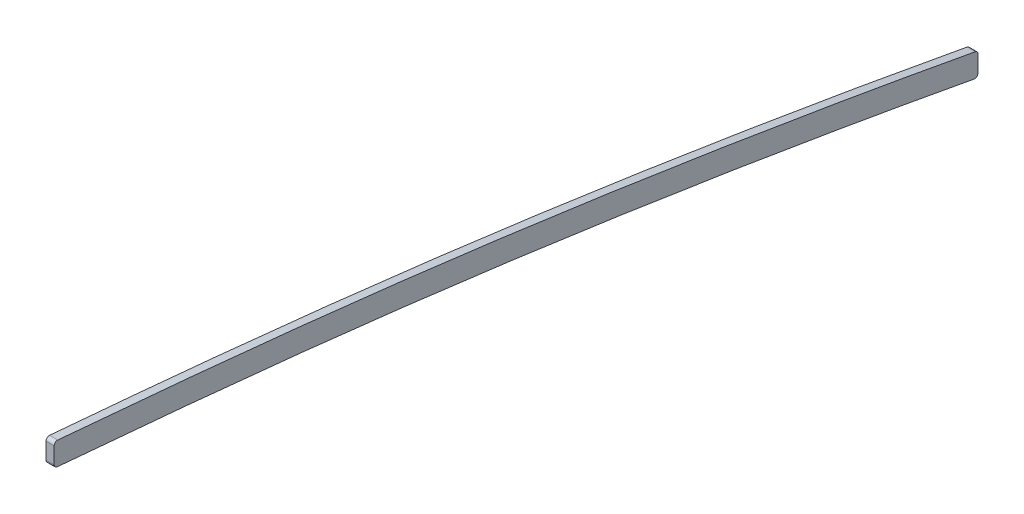
ISO-10303-21;
HEADER;
FILE_DESCRIPTION(('STEP AP214'),'2;1');
FILE_NAME('part.step','',(''),(''),'','','');
FILE_SCHEMA(('AUTOMOTIVE_DESIGN { 1 0 10303 214 1 1 1 1 }'));
ENDSEC;
DATA;
#1=APPLICATION_CONTEXT('core data for automotive mechanical design processes');
#2=APPLICATION_PROTOCOL_DEFINITION('international standard','automotive_design',2000,#1);
#3=PRODUCT_CONTEXT('',#1,'mechanical');
#4=PRODUCT('Part','Part','',(#3));
#5=PRODUCT_RELATED_PRODUCT_CATEGORY('part','',(#4));
#6=PRODUCT_DEFINITION_FORMATION('','',#4);
#7=PRODUCT_DEFINITION_CONTEXT('part definition',#1,'design');
#8=PRODUCT_DEFINITION('design','',#6,#7);
#9=PRODUCT_DEFINITION_SHAPE('','',#8);
#10=(LENGTH_UNIT() NAMED_UNIT(*) SI_UNIT(.MILLI.,.METRE.));
#11=(NAMED_UNIT(*) PLANE_ANGLE_UNIT() SI_UNIT($,.RADIAN.));
#12=(NAMED_UNIT(*) SI_UNIT($,.STERADIAN.) SOLID_ANGLE_UNIT());
#13=UNCERTAINTY_MEASURE_WITH_UNIT(LENGTH_MEASURE(1.E-05),#10,'distance_accuracy_value','');
#14=(GEOMETRIC_REPRESENTATION_CONTEXT(3) GLOBAL_UNCERTAINTY_ASSIGNED_CONTEXT((#13)) GLOBAL_UNIT_ASSIGNED_CONTEXT((#10,
#11,#12)) REPRESENTATION_CONTEXT('',''));
#15=CARTESIAN_POINT('',(0.,0.,0.));
#16=DIRECTION('',(0.,0.,1.));
#17=DIRECTION('',(1.,0.,0.));
#18=AXIS2_PLACEMENT_3D('',#15,#16,#17);
#19=CARTESIAN_POINT('',(-1.5875,0.,-2311.4));
#20=DIRECTION('',(0.,0.,1.));
#21=DIRECTION('',(1.,0.,0.));
#22=AXIS2_PLACEMENT_3D('',#19,#20,#21);
#23=PLANE('',#22);
#24=DIRECTION('',(0.,-1.,0.));
#25=VECTOR('',#24,1.);
#26=CARTESIAN_POINT('',(-1.5875,0.,-2311.4));
#27=LINE('',#26,#25);
#28=CARTESIAN_POINT('',(-1.5875,85.9058570077858,-2311.4));
#29=VERTEX_POINT('',#28);
#30=CARTESIAN_POINT('',(-1.5875,79.5328261111019,-2311.4));
#31=VERTEX_POINT('',#30);
#32=EDGE_CURVE('E155',#29,#31,#27,.T.);
#33=ORIENTED_EDGE('',*,*,#32,.T.);
#34=DIRECTION('',(1.,0.,0.));
#35=VECTOR('',#34,1.);
#36=CARTESIAN_POINT('',(-1.5875,79.5328261111019,-2311.4));
#37=LINE('',#36,#35);
#38=CARTESIAN_POINT('',(1.5875,79.5328261111019,-2311.4));
#39=VERTEX_POINT('',#38);
#40=EDGE_CURVE('E138',#31,#39,#37,.T.);
#41=ORIENTED_EDGE('',*,*,#40,.T.);
#42=DIRECTION('',(0.,-1.,0.));
#43=VECTOR('',#42,1.);
#44=CARTESIAN_POINT('',(1.5875,0.,-2311.4));
#45=LINE('',#44,#43);
#46=CARTESIAN_POINT('',(1.5875,85.9058570077858,-2311.4));
#47=VERTEX_POINT('',#46);
#48=EDGE_CURVE('E120',#47,#39,#45,.T.);
#49=ORIENTED_EDGE('',*,*,#48,.F.);
#50=DIRECTION('',(-1.,0.,0.));
#51=VECTOR('',#50,1.);
#52=CARTESIAN_POINT('',(-1.5875,85.9058570077858,-2311.4));
#53=LINE('',#52,#51);
#54=EDGE_CURVE('E135',#47,#29,#53,.T.);
#55=ORIENTED_EDGE('',*,*,#54,.T.);
#56=EDGE_LOOP('',(#33,#41,#49,#55));
#57=FACE_BOUND('',#56,.T.);
#58=ADVANCED_FACE('F51',(#57),#23,.T.);
#59=CARTESIAN_POINT('',(-1.5875,123.62374006878,-1735.81133470922));
#60=CARTESIAN_POINT('',(-1.5875,121.618292624347,-1776.13863549866));
#61=CARTESIAN_POINT('',(-1.5875,119.500621805793,-1816.46028157928));
#62=CARTESIAN_POINT('',(-1.5875,115.087561884835,-1897.09366867468));
#63=CARTESIAN_POINT('',(-1.5875,112.792971084113,-1937.4056388964));
#64=CARTESIAN_POINT('',(-1.5875,108.01836652323,-2018.0184190449));
#65=CARTESIAN_POINT('',(-1.5875,105.539122976217,-2058.31951222306));
#66=CARTESIAN_POINT('',(-1.5875,100.307240032155,-2138.90378014414));
#67=CARTESIAN_POINT('',(-1.5875,97.5551279550714,-2179.18739792965));
#68=CARTESIAN_POINT('',(-1.5875,93.0801686873999,-2239.58699871448));
#69=CARTESIAN_POINT('',(-1.5875,91.5298376215323,-2259.71628097743));
#70=CARTESIAN_POINT('',(-1.5875,89.0908434299724,-2289.90044260235));
#71=CARTESIAN_POINT('',(-1.5875,88.2588450388707,-2299.96017913521));
#72=CARTESIAN_POINT('',(-1.5875,86.5528616543479,-2320.0760045662));
#73=CARTESIAN_POINT('',(-1.5875,85.6789622226699,-2330.13210089761));
#74=CARTESIAN_POINT('',(-1.5875,83.8743348466212,-2350.23935651754));
#75=CARTESIAN_POINT('',(-1.5875,82.9433074844211,-2360.29048979378));
#76=CARTESIAN_POINT('',(-1.5875,81.0031832968026,-2380.3859739712));
#77=CARTESIAN_POINT('',(-1.5875,79.9934185550902,-2390.43006537759));
#78=CARTESIAN_POINT('',(-1.5875,76.8275775323524,-2420.5470261948));
#79=CARTESIAN_POINT('',(-1.5875,74.5336729547823,-2440.6064858901));
#80=CARTESIAN_POINT('',(-1.5875,69.5562785225382,-2480.67556956821));
#81=CARTESIAN_POINT('',(-1.5875,66.8741508113434,-2500.6871518296));
#82=CARTESIAN_POINT('',(-1.5875,61.1502462952664,-2540.65429020717));
#83=CARTESIAN_POINT('',(-1.5875,58.1097556460363,-2560.61102642776));
#84=CARTESIAN_POINT('',(-1.5875,51.7024655740435,-2600.47545713133));
#85=CARTESIAN_POINT('',(-1.5875,48.3375388880153,-2620.38296708947));
#86=CARTESIAN_POINT('',(-1.5875,43.0416957000558,-2650.1996164959));
#87=CARTESIAN_POINT('',(-1.5875,41.2345222277721,-2660.13118962649));
#88=CARTESIAN_POINT('',(-1.5875,37.5258634945269,-2679.97612471736));
#89=CARTESIAN_POINT('',(-1.5875,35.6245635215631,-2689.88973979233));
#90=CARTESIAN_POINT('',(-1.5875,33.6647813022258,-2699.79233281757));
#91=B_SPLINE_CURVE_WITH_KNOTS('',3,(#59,#60,#61,#62,#63,#64,#65,#66,#67,#68,#69,#70,#71,#72,#73,
#74,#75,#76,#77,#78,#79,#80,#81,#82,#83,#84,#85,#86,#87,#88,#89,#90),.UNSPECIFIED.,.F.,.F.,(4,2,
2,2,2,2,2,2,2,2,2,2,2,2,2,4),(0.,0.125,0.25,0.375,0.5,0.5625,0.59375,0.625,0.65625,0.6875,0.75,
0.8125,0.875,0.9375,0.96875,1.),.UNSPECIFIED.);
#92=DIRECTION('',(1.,0.,0.));
#93=VECTOR('',#92,1.);
#94=SURFACE_OF_LINEAR_EXTRUSION('',#91,#93);
#95=CARTESIAN_POINT('',(-1.5875,39.6696445897951,-2668.50268386307));
#96=CARTESIAN_POINT('',(-1.5875,41.4227181411697,-2659.09628802938));
#97=CARTESIAN_POINT('',(-1.5875,43.1336678951423,-2649.68179476314));
#98=CARTESIAN_POINT('',(-1.5875,48.3375388880153,-2620.38296708947));
#99=CARTESIAN_POINT('',(-1.5875,51.7024655740435,-2600.47545713133));
#100=CARTESIAN_POINT('',(-1.5875,58.1097556460363,-2560.61102642776));
#101=CARTESIAN_POINT('',(-1.5875,61.1502462952664,-2540.65429020717));
#102=CARTESIAN_POINT('',(-1.5875,66.8741508113434,-2500.6871518296));
#103=CARTESIAN_POINT('',(-1.5875,69.5562785225382,-2480.67556956821));
#104=CARTESIAN_POINT('',(-1.5875,74.5336729547823,-2440.6064858901));
#105=CARTESIAN_POINT('',(-1.5875,76.8275775323524,-2420.5470261948));
#106=CARTESIAN_POINT('',(-1.5875,79.9934185550902,-2390.43006537759));
#107=CARTESIAN_POINT('',(-1.5875,81.0031832968026,-2380.3859739712));
#108=CARTESIAN_POINT('',(-1.5875,82.9433074844211,-2360.29048979378));
#109=CARTESIAN_POINT('',(-1.5875,83.8743348466212,-2350.23935651754));
#110=CARTESIAN_POINT('',(-1.5875,85.5964343925108,-2331.05163043528));
#111=CARTESIAN_POINT('',(-1.5875,86.3927659735339,-2321.91549454551));
#112=CARTESIAN_POINT('',(-1.5875,87.1712727423813,-2312.77781010453));
#113=B_SPLINE_CURVE_WITH_KNOTS('',3,(#95,#96,#97,#98,#99,#100,#101,#102,#103,#104,#105,#106,
#107,#108,#109,#110,#111,#112),.UNSPECIFIED.,.F.,.F.,(4,2,2,2,2,2,2,2,4),(0.596608201894419,
0.626230058276239,0.688730058276239,0.751230058276239,0.813730058276239,0.876230058276239,
0.907480058276239,0.938730058276239,0.96712185638182),.UNSPECIFIED.);
#114=CARTESIAN_POINT('',(-1.5875,87.1712718452855,-2312.7778100281));
#115=VERTEX_POINT('',#114);
#116=CARTESIAN_POINT('',(-1.5875,39.6696450424847,-2668.50268394744));
#117=VERTEX_POINT('',#116);
#118=EDGE_CURVE('E146',#115,#117,#113,.F.);
#119=ORIENTED_EDGE('',*,*,#118,.F.);
#120=DIRECTION('',(1.,0.,0.));
#121=VECTOR('',#120,1.);
#122=CARTESIAN_POINT('',(-1.5875,87.1712727423807,-2312.77781010453));
#123=LINE('',#122,#121);
#124=CARTESIAN_POINT('',(1.5875,87.1712718487435,-2312.77781002839));
#125=VERTEX_POINT('',#124);
#126=EDGE_CURVE('E253',#115,#125,#123,.T.);
#127=ORIENTED_EDGE('',*,*,#126,.T.);
#128=CARTESIAN_POINT('',(1.5875,87.1712727423811,-2312.77781010453));
#129=CARTESIAN_POINT('',(1.5875,86.3927659735338,-2321.91549454551));
#130=CARTESIAN_POINT('',(1.5875,85.5964343925107,-2331.05163043528));
#131=CARTESIAN_POINT('',(1.5875,83.8743348466212,-2350.23935651754));
#132=CARTESIAN_POINT('',(1.5875,82.9433074844211,-2360.29048979378));
#133=CARTESIAN_POINT('',(1.5875,81.0031832968026,-2380.3859739712));
#134=CARTESIAN_POINT('',(1.5875,79.9934185550902,-2390.43006537759));
#135=CARTESIAN_POINT('',(1.5875,76.8275775323524,-2420.5470261948));
#136=CARTESIAN_POINT('',(1.5875,74.5336729547823,-2440.6064858901));
#137=CARTESIAN_POINT('',(1.5875,69.5562785225382,-2480.67556956821));
#138=CARTESIAN_POINT('',(1.5875,66.8741508113434,-2500.6871518296));
#139=CARTESIAN_POINT('',(1.5875,61.1502462952664,-2540.65429020717));
#140=CARTESIAN_POINT('',(1.5875,58.1097556460363,-2560.61102642776));
#141=CARTESIAN_POINT('',(1.5875,51.7024655740435,-2600.47545713133));
#142=CARTESIAN_POINT('',(1.5875,48.3375388880153,-2620.38296708947));
#143=CARTESIAN_POINT('',(1.5875,43.1336678951423,-2649.68179476314));
#144=CARTESIAN_POINT('',(1.5875,41.4227181411698,-2659.09628802938));
#145=CARTESIAN_POINT('',(1.5875,39.6696445897952,-2668.50268386307));
#146=B_SPLINE_CURVE_WITH_KNOTS('',3,(#128,#129,#130,#131,#132,#133,#134,#135,#136,#137,#138,
#139,#140,#141,#142,#143,#144,#145),.UNSPECIFIED.,.F.,.F.,(4,2,2,2,2,2,2,2,4),
(0.596608201894421,0.625,0.65625,0.6875,0.75,0.8125,0.875,0.9375,0.967121856381819),.UNSPECIFIED.);
#147=CARTESIAN_POINT('',(1.5875,39.669645038454,-2668.50268394669));
#148=VERTEX_POINT('',#147);
#149=EDGE_CURVE('E122',#125,#148,#146,.T.);
#150=ORIENTED_EDGE('',*,*,#149,.T.);
#151=DIRECTION('',(1.,0.,0.));
#152=VECTOR('',#151,1.);
#153=CARTESIAN_POINT('',(1.5875,39.6696445897955,-2668.50268386307));
#154=LINE('',#153,#152);
#155=EDGE_CURVE('E250',#148,#117,#154,.F.);
#156=ORIENTED_EDGE('',*,*,#155,.T.);
#157=EDGE_LOOP('',(#119,#127,#150,#156));
#158=FACE_BOUND('',#157,.T.);
#159=ADVANCED_FACE('F186',(#158),#94,.F.);
#160=CARTESIAN_POINT('',(-1.5875,5.24327465958363E-10,-2669.54000000001));
#161=DIRECTION('',(0.,1.96411166702264E-13,-1.));
#162=DIRECTION('',(0.,1.,1.96411166702264E-13));
#163=AXIS2_PLACEMENT_3D('',#160,#161,#162);
#164=PLANE('',#163);
#165=DIRECTION('',(0.,1.,1.96411166702264E-13));
#166=VECTOR('',#165,1.);
#167=CARTESIAN_POINT('',(1.5875,5.24327465958363E-10,-2669.54000000001));
#168=LINE('',#167,#166);
#169=CARTESIAN_POINT('',(1.5875,31.9615735387028,-2669.54));
#170=VERTEX_POINT('',#169);
#171=CARTESIAN_POINT('',(1.5875,38.4211421989826,-2669.54));
#172=VERTEX_POINT('',#171);
#173=EDGE_CURVE('E158',#170,#172,#168,.T.);
#174=ORIENTED_EDGE('',*,*,#173,.F.);
#175=DIRECTION('',(1.,0.,0.));
#176=VECTOR('',#175,1.);
#177=CARTESIAN_POINT('',(-1.5875,31.9615735387028,-2669.54));
#178=LINE('',#177,#176);
#179=CARTESIAN_POINT('',(-1.5875,31.9615735387028,-2669.54));
#180=VERTEX_POINT('',#179);
#181=EDGE_CURVE('E11',#170,#180,#178,.F.);
#182=ORIENTED_EDGE('',*,*,#181,.T.);
#183=DIRECTION('',(0.,1.,1.96411166702264E-13));
#184=VECTOR('',#183,1.);
#185=CARTESIAN_POINT('',(-1.5875,5.24327465958363E-10,-2669.54000000001));
#186=LINE('',#185,#184);
#187=CARTESIAN_POINT('',(-1.5875,38.4211421989826,-2669.54));
#188=VERTEX_POINT('',#187);
#189=EDGE_CURVE('E153',#180,#188,#186,.T.);
#190=ORIENTED_EDGE('',*,*,#189,.T.);
#191=DIRECTION('',(-1.,0.,0.));
#192=VECTOR('',#191,1.);
#193=CARTESIAN_POINT('',(1.5875,38.4211421989826,-2669.54));
#194=LINE('',#193,#192);
#195=EDGE_CURVE('E60',#188,#172,#194,.F.);
#196=ORIENTED_EDGE('',*,*,#195,.T.);
#197=EDGE_LOOP('',(#174,#182,#190,#196));
#198=FACE_BOUND('',#197,.T.);
#199=ADVANCED_FACE('F191',(#198),#164,.T.);
#200=CARTESIAN_POINT('',(-1.5875,114.744712211049,-1735.36978708818));
#201=CARTESIAN_POINT('',(-1.5875,110.735232017816,-1815.99594072318));
#202=CARTESIAN_POINT('',(-1.5875,104.09636454831,-1936.9066504622));
#203=CARTESIAN_POINT('',(-1.5875,94.1879787504419,-2098.04948516813));
#204=CARTESIAN_POINT('',(-1.5875,87.3146385091305,-2198.69473672509));
#205=CARTESIAN_POINT('',(-1.5875,82.2221004379246,-2264.7604207429));
#206=CARTESIAN_POINT('',(-1.5875,79.2861290791442,-2300.64406981759));
#207=CARTESIAN_POINT('',(-1.5875,77.5184226804242,-2321.44664588428));
#208=CARTESIAN_POINT('',(-1.5875,74.4619434735392,-2355.87015988009));
#209=CARTESIAN_POINT('',(-1.5875,70.2016989360763,-2400.27195264392));
#210=CARTESIAN_POINT('',(-1.5875,61.1273782537238,-2479.57046826411));
#211=CARTESIAN_POINT('',(-1.5875,49.6509076137669,-2559.29208787163));
#212=CARTESIAN_POINT('',(-1.5875,38.2354847347183,-2626.79755458493));
#213=CARTESIAN_POINT('',(-1.5875,32.3571302958871,-2659.27265183733));
#214=CARTESIAN_POINT('',(-1.5875,28.6522110138429,-2679.06248770776));
#215=CARTESIAN_POINT('',(-1.5875,26.3541994456866,-2690.94044026322));
#216=CARTESIAN_POINT('',(-1.5875,24.9439248982718,-2698.06642332353));
#217=B_SPLINE_CURVE_WITH_KNOTS('',3,(#200,#201,#202,#203,#204,#205,#206,#207,#208,#209,#210,
#211,#212,#213,#214,#215,#216),.UNSPECIFIED.,.F.,.F.,(4,1,1,1,1,1,1,1,1,1,1,1,1,1,4),(0.,0.25,
0.375,0.5,0.5625,0.580337004871943,0.611587004871943,0.627212004871943,0.6875,0.75,0.875,0.9375,
0.962410670199827,0.977446402119896,1.),.UNSPECIFIED.);
#218=DIRECTION('',(1.,0.,0.));
#219=VECTOR('',#218,1.);
#220=SURFACE_OF_LINEAR_EXTRUSION('',#217,#219);
#221=CARTESIAN_POINT('',(1.5875,114.744712211049,-1735.36978708818));
#222=CARTESIAN_POINT('',(1.5875,110.735232017816,-1815.99594072318));
#223=CARTESIAN_POINT('',(1.5875,104.09636454831,-1936.9066504622));
#224=CARTESIAN_POINT('',(1.5875,94.1879787504419,-2098.04948516813));
#225=CARTESIAN_POINT('',(1.5875,87.3146385091305,-2198.69473672509));
#226=CARTESIAN_POINT('',(1.5875,82.2221004379246,-2264.7604207429));
#227=CARTESIAN_POINT('',(1.5875,79.2861290791442,-2300.64406981759));
#228=CARTESIAN_POINT('',(1.5875,77.5184226804242,-2321.44664588428));
#229=CARTESIAN_POINT('',(1.5875,74.4619434735392,-2355.87015988009));
#230=CARTESIAN_POINT('',(1.5875,70.2016989360763,-2400.27195264392));
#231=CARTESIAN_POINT('',(1.5875,61.1273782537238,-2479.57046826411));
#232=CARTESIAN_POINT('',(1.5875,49.6509076137669,-2559.29208787163));
#233=CARTESIAN_POINT('',(1.5875,38.2354847347183,-2626.79755458493));
#234=CARTESIAN_POINT('',(1.5875,32.3571302958871,-2659.27265183733));
#235=CARTESIAN_POINT('',(1.5875,28.6522110138429,-2679.06248770776));
#236=CARTESIAN_POINT('',(1.5875,26.3541994456866,-2690.94044026322));
#237=CARTESIAN_POINT('',(1.5875,24.9439248982718,-2698.06642332353));
#238=B_SPLINE_CURVE_WITH_KNOTS('',3,(#221,#222,#223,#224,#225,#226,#227,#228,#229,#230,#231,
#232,#233,#234,#235,#236,#237),.UNSPECIFIED.,.F.,.F.,(4,1,1,1,1,1,1,1,1,1,1,1,1,1,4),(0.,0.25,
0.375,0.5,0.5625,0.580337004871943,0.611587004871943,0.627212004871943,0.6875,0.75,0.875,0.9375,
0.962410670199827,0.977446402119896,1.),.UNSPECIFIED.);
#239=CARTESIAN_POINT('',(1.5875,78.2674197143551,-2312.562080349));
#240=VERTEX_POINT('',#239);
#241=CARTESIAN_POINT('',(1.5875,30.71315574617,-2668.03686266861));
#242=VERTEX_POINT('',#241);
#243=EDGE_CURVE('E140',#240,#242,#238,.T.);
#244=ORIENTED_EDGE('',*,*,#243,.F.);
#245=DIRECTION('',(1.,0.,0.));
#246=VECTOR('',#245,1.);
#247=CARTESIAN_POINT('',(1.5875,78.2674197143551,-2312.562080349));
#248=LINE('',#247,#246);
#249=CARTESIAN_POINT('',(-1.5875,78.2674197143551,-2312.562080349));
#250=VERTEX_POINT('',#249);
#251=EDGE_CURVE('E229',#240,#250,#248,.F.);
#252=ORIENTED_EDGE('',*,*,#251,.T.);
#253=CARTESIAN_POINT('',(-1.5875,30.71315574617,-2668.03686266861));
#254=VERTEX_POINT('',#253);
#255=EDGE_CURVE('E201',#250,#254,#217,.T.);
#256=ORIENTED_EDGE('',*,*,#255,.T.);
#257=DIRECTION('',(1.,0.,0.));
#258=VECTOR('',#257,1.);
#259=CARTESIAN_POINT('',(-1.5875,30.7131557461701,-2668.03686266861));
#260=LINE('',#259,#258);
#261=EDGE_CURVE('E279',#254,#242,#260,.T.);
#262=ORIENTED_EDGE('',*,*,#261,.T.);
#263=EDGE_LOOP('',(#244,#252,#256,#262));
#264=FACE_BOUND('',#263,.T.);
#265=ADVANCED_FACE('F288',(#264),#220,.T.);
#266=CARTESIAN_POINT('',(-1.5875,0.,0.));
#267=DIRECTION('',(1.,0.,0.));
#268=DIRECTION('',(0.,0.,-1.));
#269=AXIS2_PLACEMENT_3D('',#266,#267,#268);
#270=PLANE('',#269);
#271=ORIENTED_EDGE('',*,*,#255,.F.);
#272=CARTESIAN_POINT('',(-1.5875,79.5328261111019,-2312.67));
#273=DIRECTION('',(1.,0.,0.));
#274=DIRECTION('',(0.,0.,-1.));
#275=AXIS2_PLACEMENT_3D('',#272,#273,#274);
#276=CIRCLE('',#275,1.27);
#277=EDGE_CURVE('E245',#250,#31,#276,.F.);
#278=ORIENTED_EDGE('',*,*,#277,.T.);
#279=ORIENTED_EDGE('',*,*,#32,.F.);
#280=CARTESIAN_POINT('',(-1.5875,85.9058570077858,-2312.67));
#281=DIRECTION('',(1.,0.,0.));
#282=DIRECTION('',(0.,0.,-1.));
#283=AXIS2_PLACEMENT_3D('',#280,#281,#282);
#284=CIRCLE('',#283,1.27);
#285=EDGE_CURVE('E144',#29,#115,#284,.F.);
#286=ORIENTED_EDGE('',*,*,#285,.T.);
#287=ORIENTED_EDGE('',*,*,#118,.T.);
#288=CARTESIAN_POINT('',(-1.5875,38.4211421989823,-2668.27));
#289=DIRECTION('',(1.,0.,0.));
#290=DIRECTION('',(0.,0.,-1.));
#291=AXIS2_PLACEMENT_3D('',#288,#289,#290);
#292=CIRCLE('',#291,1.27);
#293=EDGE_CURVE('E67',#117,#188,#292,.F.);
#294=ORIENTED_EDGE('',*,*,#293,.T.);
#295=ORIENTED_EDGE('',*,*,#189,.F.);
#296=CARTESIAN_POINT('',(-1.5875,31.9615735387025,-2668.27));
#297=DIRECTION('',(1.,0.,0.));
#298=DIRECTION('',(0.,0.,-1.));
#299=AXIS2_PLACEMENT_3D('',#296,#297,#298);
#300=CIRCLE('',#299,1.27);
#301=EDGE_CURVE('E238',#180,#254,#300,.F.);
#302=ORIENTED_EDGE('',*,*,#301,.T.);
#303=EDGE_LOOP('',(#271,#278,#279,#286,#287,#294,#295,#302));
#304=FACE_BOUND('',#303,.T.);
#305=ADVANCED_FACE('F184',(#304),#270,.F.);
#306=CARTESIAN_POINT('',(1.5875,0.,0.));
#307=DIRECTION('',(1.,0.,0.));
#308=DIRECTION('',(0.,0.,-1.));
#309=AXIS2_PLACEMENT_3D('',#306,#307,#308);
#310=PLANE('',#309);
#311=ORIENTED_EDGE('',*,*,#48,.T.);
#312=CARTESIAN_POINT('',(1.5875,79.5328261111019,-2312.67));
#313=DIRECTION('',(1.,0.,0.));
#314=DIRECTION('',(0.,0.,-1.));
#315=AXIS2_PLACEMENT_3D('',#312,#313,#314);
#316=CIRCLE('',#315,1.27);
#317=EDGE_CURVE('E129',#39,#240,#316,.T.);
#318=ORIENTED_EDGE('',*,*,#317,.T.);
#319=ORIENTED_EDGE('',*,*,#243,.T.);
#320=CARTESIAN_POINT('',(1.5875,31.9615735387025,-2668.27));
#321=DIRECTION('',(1.,0.,0.));
#322=DIRECTION('',(0.,0.,-1.));
#323=AXIS2_PLACEMENT_3D('',#320,#321,#322);
#324=CIRCLE('',#323,1.27);
#325=EDGE_CURVE('E130',#242,#170,#324,.T.);
#326=ORIENTED_EDGE('',*,*,#325,.T.);
#327=ORIENTED_EDGE('',*,*,#173,.T.);
#328=CARTESIAN_POINT('',(1.5875,38.4211421989823,-2668.27));
#329=DIRECTION('',(1.,0.,0.));
#330=DIRECTION('',(0.,0.,-1.));
#331=AXIS2_PLACEMENT_3D('',#328,#329,#330);
#332=CIRCLE('',#331,1.27);
#333=EDGE_CURVE('E151',#172,#148,#332,.T.);
#334=ORIENTED_EDGE('',*,*,#333,.T.);
#335=ORIENTED_EDGE('',*,*,#149,.F.);
#336=CARTESIAN_POINT('',(1.5875,85.9058570077858,-2312.67));
#337=DIRECTION('',(1.,0.,0.));
#338=DIRECTION('',(0.,0.,-1.));
#339=AXIS2_PLACEMENT_3D('',#336,#337,#338);
#340=CIRCLE('',#339,1.27);
#341=EDGE_CURVE('E117',#125,#47,#340,.T.);
#342=ORIENTED_EDGE('',*,*,#341,.T.);
#343=EDGE_LOOP('',(#311,#318,#319,#326,#327,#334,#335,#342));
#344=FACE_BOUND('',#343,.T.);
#345=ADVANCED_FACE('F119',(#344),#310,.T.);
#346=CARTESIAN_POINT('',(0.,79.5328261111019,-2312.67));
#347=DIRECTION('',(1.,0.,0.));
#348=DIRECTION('',(0.,0.,-1.));
#349=AXIS2_PLACEMENT_3D('',#346,#347,#348);
#350=CYLINDRICAL_SURFACE('',#349,1.27);
#351=ORIENTED_EDGE('',*,*,#277,.F.);
#352=ORIENTED_EDGE('',*,*,#251,.F.);
#353=ORIENTED_EDGE('',*,*,#317,.F.);
#354=ORIENTED_EDGE('',*,*,#40,.F.);
#355=EDGE_LOOP('',(#351,#352,#353,#354));
#356=FACE_BOUND('',#355,.T.);
#357=ADVANCED_FACE('F183',(#356),#350,.T.);
#358=CARTESIAN_POINT('',(0.,85.9058570077858,-2312.67));
#359=DIRECTION('',(1.,0.,0.));
#360=DIRECTION('',(0.,0.,-1.));
#361=AXIS2_PLACEMENT_3D('',#358,#359,#360);
#362=CYLINDRICAL_SURFACE('',#361,1.27);
#363=ORIENTED_EDGE('',*,*,#285,.F.);
#364=ORIENTED_EDGE('',*,*,#54,.F.);
#365=ORIENTED_EDGE('',*,*,#341,.F.);
#366=ORIENTED_EDGE('',*,*,#126,.F.);
#367=EDGE_LOOP('',(#363,#364,#365,#366));
#368=FACE_BOUND('',#367,.T.);
#369=ADVANCED_FACE('F143',(#368),#362,.T.);
#370=CARTESIAN_POINT('',(0.,31.9615735387025,-2668.27));
#371=DIRECTION('',(1.,0.,0.));
#372=DIRECTION('',(0.,0.,-1.));
#373=AXIS2_PLACEMENT_3D('',#370,#371,#372);
#374=CYLINDRICAL_SURFACE('',#373,1.27);
#375=ORIENTED_EDGE('',*,*,#301,.F.);
#376=ORIENTED_EDGE('',*,*,#181,.F.);
#377=ORIENTED_EDGE('',*,*,#325,.F.);
#378=ORIENTED_EDGE('',*,*,#261,.F.);
#379=EDGE_LOOP('',(#375,#376,#377,#378));
#380=FACE_BOUND('',#379,.T.);
#381=ADVANCED_FACE('F298',(#380),#374,.T.);
#382=CARTESIAN_POINT('',(0.,38.4211421989823,-2668.27));
#383=DIRECTION('',(1.,0.,0.));
#384=DIRECTION('',(0.,0.,-1.));
#385=AXIS2_PLACEMENT_3D('',#382,#383,#384);
#386=CYLINDRICAL_SURFACE('',#385,1.27);
#387=ORIENTED_EDGE('',*,*,#293,.F.);
#388=ORIENTED_EDGE('',*,*,#155,.F.);
#389=ORIENTED_EDGE('',*,*,#333,.F.);
#390=ORIENTED_EDGE('',*,*,#195,.F.);
#391=EDGE_LOOP('',(#387,#388,#389,#390));
#392=FACE_BOUND('',#391,.T.);
#393=ADVANCED_FACE('F53',(#392),#386,.T.);
#394=CLOSED_SHELL('',(#58,#159,#199,#265,#305,#345,#357,#369,#381,#393));
#395=MANIFOLD_SOLID_BREP('B2',#394);
#396=ADVANCED_BREP_SHAPE_REPRESENTATION('',(#18,#395),#14);
#397=SHAPE_DEFINITION_REPRESENTATION(#9,#396);
ENDSEC;
END-ISO-10303-21;
